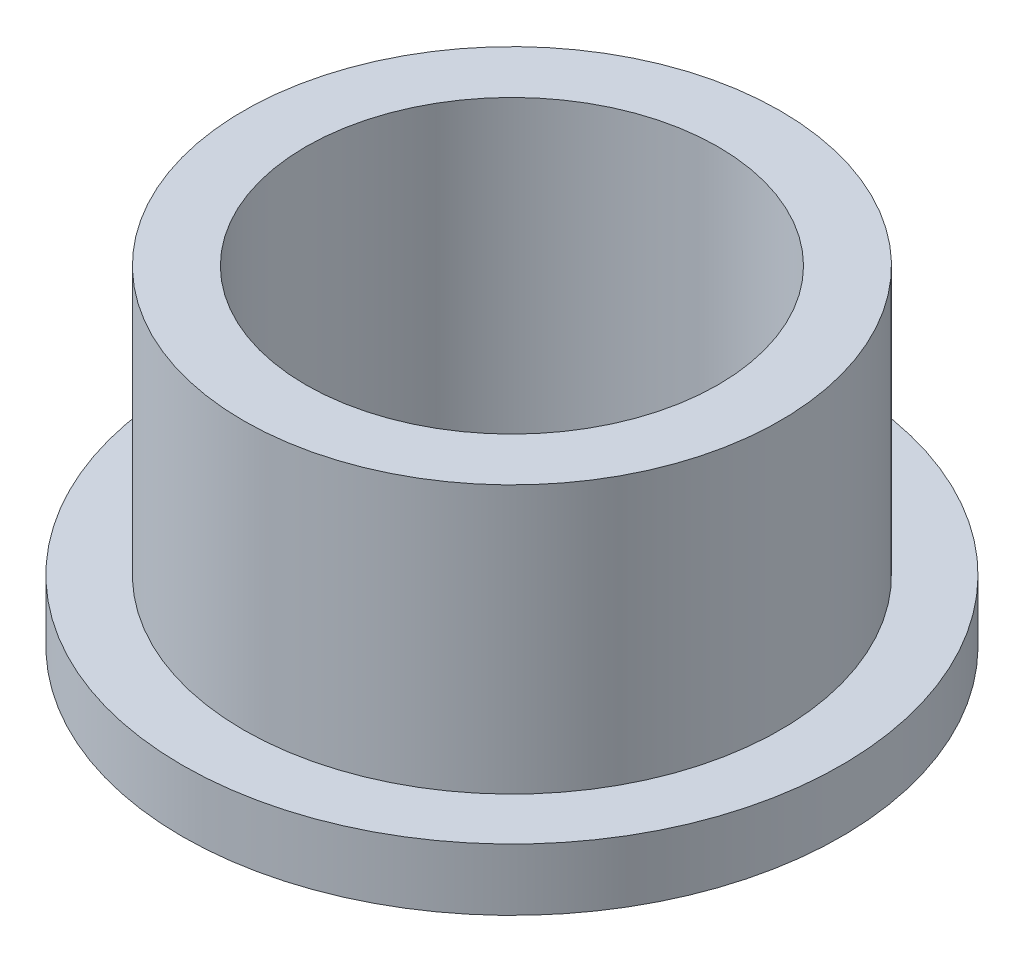
ISO-10303-21;
HEADER;
FILE_DESCRIPTION(('STEP AP214'),'2;1');
FILE_NAME('part.step','',(''),(''),'','','');
FILE_SCHEMA(('AUTOMOTIVE_DESIGN { 1 0 10303 214 1 1 1 1 }'));
ENDSEC;
DATA;
#1=APPLICATION_CONTEXT('core data for automotive mechanical design processes');
#2=APPLICATION_PROTOCOL_DEFINITION('international standard','automotive_design',2000,#1);
#3=PRODUCT_CONTEXT('',#1,'mechanical');
#4=PRODUCT('Part','Part','',(#3));
#5=PRODUCT_RELATED_PRODUCT_CATEGORY('part','',(#4));
#6=PRODUCT_DEFINITION_FORMATION('','',#4);
#7=PRODUCT_DEFINITION_CONTEXT('part definition',#1,'design');
#8=PRODUCT_DEFINITION('design','',#6,#7);
#9=PRODUCT_DEFINITION_SHAPE('','',#8);
#10=(LENGTH_UNIT() NAMED_UNIT(*) SI_UNIT(.MILLI.,.METRE.));
#11=(NAMED_UNIT(*) PLANE_ANGLE_UNIT() SI_UNIT($,.RADIAN.));
#12=(NAMED_UNIT(*) SI_UNIT($,.STERADIAN.) SOLID_ANGLE_UNIT());
#13=UNCERTAINTY_MEASURE_WITH_UNIT(LENGTH_MEASURE(1.E-05),#10,'distance_accuracy_value','');
#14=(GEOMETRIC_REPRESENTATION_CONTEXT(3) GLOBAL_UNCERTAINTY_ASSIGNED_CONTEXT((#13)) GLOBAL_UNIT_ASSIGNED_CONTEXT((#10,
#11,#12)) REPRESENTATION_CONTEXT('',''));
#15=CARTESIAN_POINT('',(0.,0.,0.));
#16=DIRECTION('',(0.,0.,1.));
#17=DIRECTION('',(1.,0.,0.));
#18=AXIS2_PLACEMENT_3D('',#15,#16,#17);
#19=CARTESIAN_POINT('',(0.,8.,0.));
#20=DIRECTION('',(0.,1.,0.));
#21=DIRECTION('',(0.,0.,1.));
#22=AXIS2_PLACEMENT_3D('',#19,#20,#21);
#23=PLANE('',#22);
#24=CARTESIAN_POINT('',(0.,8.,0.));
#25=DIRECTION('',(0.,1.,0.));
#26=DIRECTION('',(0.,0.,1.));
#27=AXIS2_PLACEMENT_3D('',#24,#25,#26);
#28=CIRCLE('',#27,6.515);
#29=CARTESIAN_POINT('',(0.,8.,6.515));
#30=VERTEX_POINT('',#29);
#31=EDGE_CURVE('E10',#30,#30,#28,.T.);
#32=ORIENTED_EDGE('',*,*,#31,.T.);
#33=EDGE_LOOP('',(#32));
#34=FACE_BOUND('',#33,.T.);
#35=CARTESIAN_POINT('',(0.,8.,0.));
#36=DIRECTION('',(0.,1.,0.));
#37=DIRECTION('',(0.,0.,1.));
#38=AXIS2_PLACEMENT_3D('',#35,#36,#37);
#39=CIRCLE('',#38,5.005);
#40=CARTESIAN_POINT('',(0.,8.,5.005));
#41=VERTEX_POINT('',#40);
#42=EDGE_CURVE('E40',#41,#41,#39,.T.);
#43=ORIENTED_EDGE('',*,*,#42,.F.);
#44=EDGE_LOOP('',(#43));
#45=FACE_BOUND('',#44,.T.);
#46=ADVANCED_FACE('F33',(#34,#45),#23,.T.);
#47=CARTESIAN_POINT('',(0.,0.,0.));
#48=DIRECTION('',(0.,1.,0.));
#49=DIRECTION('',(0.,0.,1.));
#50=AXIS2_PLACEMENT_3D('',#47,#48,#49);
#51=PLANE('',#50);
#52=CARTESIAN_POINT('',(0.,0.,0.));
#53=DIRECTION('',(0.,1.,0.));
#54=DIRECTION('',(0.,0.,1.));
#55=AXIS2_PLACEMENT_3D('',#52,#53,#54);
#56=CIRCLE('',#55,5.005);
#57=CARTESIAN_POINT('',(0.,0.,5.005));
#58=VERTEX_POINT('',#57);
#59=EDGE_CURVE('E44',#58,#58,#56,.T.);
#60=ORIENTED_EDGE('',*,*,#59,.T.);
#61=EDGE_LOOP('',(#60));
#62=FACE_BOUND('',#61,.T.);
#63=CARTESIAN_POINT('',(0.,0.,0.));
#64=DIRECTION('',(0.,1.,0.));
#65=DIRECTION('',(0.,0.,1.));
#66=AXIS2_PLACEMENT_3D('',#63,#64,#65);
#67=CIRCLE('',#66,8.);
#68=CARTESIAN_POINT('',(0.,0.,8.));
#69=VERTEX_POINT('',#68);
#70=EDGE_CURVE('E51',#69,#69,#67,.T.);
#71=ORIENTED_EDGE('',*,*,#70,.F.);
#72=EDGE_LOOP('',(#71));
#73=FACE_BOUND('',#72,.T.);
#74=ADVANCED_FACE('F76',(#62,#73),#51,.F.);
#75=CARTESIAN_POINT('',(0.,8.,0.));
#76=DIRECTION('',(0.,-1.,0.));
#77=DIRECTION('',(0.,0.,-1.));
#78=AXIS2_PLACEMENT_3D('',#75,#76,#77);
#79=CYLINDRICAL_SURFACE('',#78,6.515);
#80=CARTESIAN_POINT('',(0.,1.5,0.));
#81=DIRECTION('',(0.,1.,0.));
#82=DIRECTION('',(0.,0.,1.));
#83=AXIS2_PLACEMENT_3D('',#80,#81,#82);
#84=CIRCLE('',#83,6.515);
#85=CARTESIAN_POINT('',(0.,1.5,6.515));
#86=VERTEX_POINT('',#85);
#87=EDGE_CURVE('E54',#86,#86,#84,.T.);
#88=ORIENTED_EDGE('',*,*,#87,.T.);
#89=EDGE_LOOP('',(#88));
#90=FACE_BOUND('',#89,.T.);
#91=ORIENTED_EDGE('',*,*,#31,.F.);
#92=EDGE_LOOP('',(#91));
#93=FACE_BOUND('',#92,.T.);
#94=ADVANCED_FACE('F35',(#90,#93),#79,.T.);
#95=CARTESIAN_POINT('',(0.,8.,0.));
#96=DIRECTION('',(0.,-1.,0.));
#97=DIRECTION('',(0.,0.,-1.));
#98=AXIS2_PLACEMENT_3D('',#95,#96,#97);
#99=CYLINDRICAL_SURFACE('',#98,5.005);
#100=ORIENTED_EDGE('',*,*,#42,.T.);
#101=EDGE_LOOP('',(#100));
#102=FACE_BOUND('',#101,.T.);
#103=ORIENTED_EDGE('',*,*,#59,.F.);
#104=EDGE_LOOP('',(#103));
#105=FACE_BOUND('',#104,.T.);
#106=ADVANCED_FACE('F65',(#102,#105),#99,.F.);
#107=CARTESIAN_POINT('',(0.,1.5,0.));
#108=DIRECTION('',(0.,1.,0.));
#109=DIRECTION('',(0.,0.,1.));
#110=AXIS2_PLACEMENT_3D('',#107,#108,#109);
#111=PLANE('',#110);
#112=CARTESIAN_POINT('',(0.,1.5,0.));
#113=DIRECTION('',(0.,1.,0.));
#114=DIRECTION('',(0.,0.,1.));
#115=AXIS2_PLACEMENT_3D('',#112,#113,#114);
#116=CIRCLE('',#115,8.);
#117=CARTESIAN_POINT('',(0.,1.5,8.));
#118=VERTEX_POINT('',#117);
#119=EDGE_CURVE('E49',#118,#118,#116,.T.);
#120=ORIENTED_EDGE('',*,*,#119,.T.);
#121=EDGE_LOOP('',(#120));
#122=FACE_BOUND('',#121,.T.);
#123=ORIENTED_EDGE('',*,*,#87,.F.);
#124=EDGE_LOOP('',(#123));
#125=FACE_BOUND('',#124,.T.);
#126=ADVANCED_FACE('F62',(#122,#125),#111,.T.);
#127=CARTESIAN_POINT('',(0.,1.5,0.));
#128=DIRECTION('',(0.,-1.,0.));
#129=DIRECTION('',(0.,0.,-1.));
#130=AXIS2_PLACEMENT_3D('',#127,#128,#129);
#131=CYLINDRICAL_SURFACE('',#130,8.);
#132=ORIENTED_EDGE('',*,*,#119,.F.);
#133=EDGE_LOOP('',(#132));
#134=FACE_BOUND('',#133,.T.);
#135=ORIENTED_EDGE('',*,*,#70,.T.);
#136=EDGE_LOOP('',(#135));
#137=FACE_BOUND('',#136,.T.);
#138=ADVANCED_FACE('F64',(#134,#137),#131,.T.);
#139=CLOSED_SHELL('',(#46,#74,#94,#106,#126,#138));
#140=MANIFOLD_SOLID_BREP('B2',#139);
#141=ADVANCED_BREP_SHAPE_REPRESENTATION('',(#18,#140),#14);
#142=SHAPE_DEFINITION_REPRESENTATION(#9,#141);
ENDSEC;
END-ISO-10303-21;
